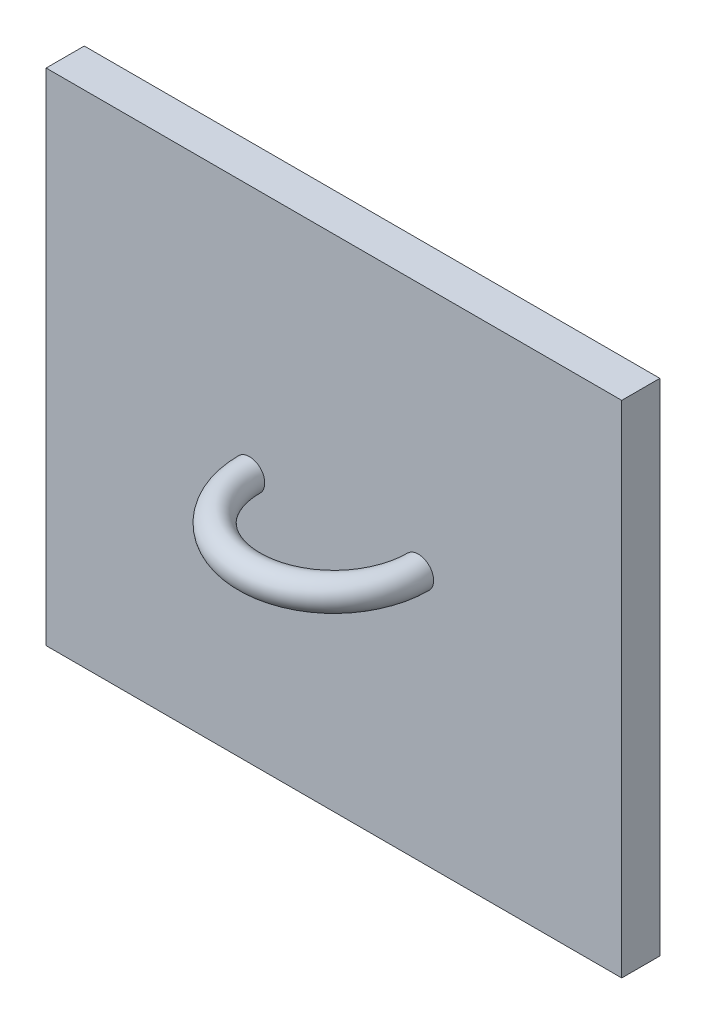
ISO-10303-21;
HEADER;
FILE_DESCRIPTION(('STEP AP214'),'2;1');
FILE_NAME('part.step','',(''),(''),'','','');
FILE_SCHEMA(('AUTOMOTIVE_DESIGN { 1 0 10303 214 1 1 1 1 }'));
ENDSEC;
DATA;
#1=APPLICATION_CONTEXT('core data for automotive mechanical design processes');
#2=APPLICATION_PROTOCOL_DEFINITION('international standard','automotive_design',2000,#1);
#3=PRODUCT_CONTEXT('',#1,'mechanical');
#4=PRODUCT('Part','Part','',(#3));
#5=PRODUCT_RELATED_PRODUCT_CATEGORY('part','',(#4));
#6=PRODUCT_DEFINITION_FORMATION('','',#4);
#7=PRODUCT_DEFINITION_CONTEXT('part definition',#1,'design');
#8=PRODUCT_DEFINITION('design','',#6,#7);
#9=PRODUCT_DEFINITION_SHAPE('','',#8);
#10=(LENGTH_UNIT() NAMED_UNIT(*) SI_UNIT(.MILLI.,.METRE.));
#11=(NAMED_UNIT(*) PLANE_ANGLE_UNIT() SI_UNIT($,.RADIAN.));
#12=(NAMED_UNIT(*) SI_UNIT($,.STERADIAN.) SOLID_ANGLE_UNIT());
#13=UNCERTAINTY_MEASURE_WITH_UNIT(LENGTH_MEASURE(1.E-05),#10,'distance_accuracy_value','');
#14=(GEOMETRIC_REPRESENTATION_CONTEXT(3) GLOBAL_UNCERTAINTY_ASSIGNED_CONTEXT((#13)) GLOBAL_UNIT_ASSIGNED_CONTEXT((#10,
#11,#12)) REPRESENTATION_CONTEXT('',''));
#15=CARTESIAN_POINT('',(0.,0.,0.));
#16=DIRECTION('',(0.,0.,1.));
#17=DIRECTION('',(1.,0.,0.));
#18=AXIS2_PLACEMENT_3D('',#15,#16,#17);
#19=CARTESIAN_POINT('',(0.,0.,12.5));
#20=DIRECTION('',(1.,0.,0.));
#21=DIRECTION('',(0.,1.,0.));
#22=AXIS2_PLACEMENT_3D('',#19,#20,#21);
#23=PLANE('',#22);
#24=DIRECTION('',(0.,-1.,0.));
#25=VECTOR('',#24,1.);
#26=CARTESIAN_POINT('',(0.,0.,0.));
#27=LINE('',#26,#25);
#28=CARTESIAN_POINT('',(0.,164.,0.));
#29=VERTEX_POINT('',#28);
#30=CARTESIAN_POINT('',(0.,0.,0.));
#31=VERTEX_POINT('',#30);
#32=EDGE_CURVE('E111',#29,#31,#27,.T.);
#33=ORIENTED_EDGE('',*,*,#32,.T.);
#34=DIRECTION('',(0.,0.,-1.));
#35=VECTOR('',#34,1.);
#36=CARTESIAN_POINT('',(0.,0.,12.5));
#37=LINE('',#36,#35);
#38=CARTESIAN_POINT('',(0.,0.,12.5));
#39=VERTEX_POINT('',#38);
#40=EDGE_CURVE('E100',#39,#31,#37,.T.);
#41=ORIENTED_EDGE('',*,*,#40,.F.);
#42=DIRECTION('',(0.,-1.,0.));
#43=VECTOR('',#42,1.);
#44=CARTESIAN_POINT('',(0.,0.,12.5));
#45=LINE('',#44,#43);
#46=CARTESIAN_POINT('',(0.,164.,12.5));
#47=VERTEX_POINT('',#46);
#48=EDGE_CURVE('E92',#47,#39,#45,.T.);
#49=ORIENTED_EDGE('',*,*,#48,.F.);
#50=DIRECTION('',(0.,0.,-1.));
#51=VECTOR('',#50,1.);
#52=CARTESIAN_POINT('',(0.,164.,12.5));
#53=LINE('',#52,#51);
#54=EDGE_CURVE('E107',#47,#29,#53,.T.);
#55=ORIENTED_EDGE('',*,*,#54,.T.);
#56=EDGE_LOOP('',(#33,#41,#49,#55));
#57=FACE_BOUND('',#56,.T.);
#58=ADVANCED_FACE('F39',(#57),#23,.F.);
#59=CARTESIAN_POINT('',(0.,0.,12.5));
#60=DIRECTION('',(0.,1.,0.));
#61=DIRECTION('',(0.,0.,1.));
#62=AXIS2_PLACEMENT_3D('',#59,#60,#61);
#63=PLANE('',#62);
#64=DIRECTION('',(1.,0.,0.));
#65=VECTOR('',#64,1.);
#66=CARTESIAN_POINT('',(0.,0.,0.));
#67=LINE('',#66,#65);
#68=CARTESIAN_POINT('',(188.7,0.,0.));
#69=VERTEX_POINT('',#68);
#70=EDGE_CURVE('E98',#31,#69,#67,.T.);
#71=ORIENTED_EDGE('',*,*,#70,.T.);
#72=DIRECTION('',(0.,0.,-1.));
#73=VECTOR('',#72,1.);
#74=CARTESIAN_POINT('',(188.7,0.,12.5));
#75=LINE('',#74,#73);
#76=CARTESIAN_POINT('',(188.7,0.,12.5));
#77=VERTEX_POINT('',#76);
#78=EDGE_CURVE('E96',#77,#69,#75,.T.);
#79=ORIENTED_EDGE('',*,*,#78,.F.);
#80=DIRECTION('',(1.,0.,0.));
#81=VECTOR('',#80,1.);
#82=CARTESIAN_POINT('',(0.,0.,12.5));
#83=LINE('',#82,#81);
#84=EDGE_CURVE('E87',#39,#77,#83,.T.);
#85=ORIENTED_EDGE('',*,*,#84,.F.);
#86=ORIENTED_EDGE('',*,*,#40,.T.);
#87=EDGE_LOOP('',(#71,#79,#85,#86));
#88=FACE_BOUND('',#87,.T.);
#89=ADVANCED_FACE('F97',(#88),#63,.F.);
#90=CARTESIAN_POINT('',(188.7,0.,12.5));
#91=DIRECTION('',(-1.,0.,0.));
#92=DIRECTION('',(0.,-1.,0.));
#93=AXIS2_PLACEMENT_3D('',#90,#91,#92);
#94=PLANE('',#93);
#95=DIRECTION('',(0.,1.,0.));
#96=VECTOR('',#95,1.);
#97=CARTESIAN_POINT('',(188.7,0.,0.));
#98=LINE('',#97,#96);
#99=CARTESIAN_POINT('',(188.7,164.,0.));
#100=VERTEX_POINT('',#99);
#101=EDGE_CURVE('E73',#69,#100,#98,.T.);
#102=ORIENTED_EDGE('',*,*,#101,.T.);
#103=DIRECTION('',(0.,0.,-1.));
#104=VECTOR('',#103,1.);
#105=CARTESIAN_POINT('',(188.7,164.,12.5));
#106=LINE('',#105,#104);
#107=CARTESIAN_POINT('',(188.7,164.,12.5));
#108=VERTEX_POINT('',#107);
#109=EDGE_CURVE('E101',#108,#100,#106,.T.);
#110=ORIENTED_EDGE('',*,*,#109,.F.);
#111=DIRECTION('',(0.,1.,0.));
#112=VECTOR('',#111,1.);
#113=CARTESIAN_POINT('',(188.7,0.,12.5));
#114=LINE('',#113,#112);
#115=EDGE_CURVE('E90',#77,#108,#114,.T.);
#116=ORIENTED_EDGE('',*,*,#115,.F.);
#117=ORIENTED_EDGE('',*,*,#78,.T.);
#118=EDGE_LOOP('',(#102,#110,#116,#117));
#119=FACE_BOUND('',#118,.T.);
#120=ADVANCED_FACE('F103',(#119),#94,.F.);
#121=CARTESIAN_POINT('',(0.,164.,12.5));
#122=DIRECTION('',(0.,-1.,0.));
#123=DIRECTION('',(0.,0.,-1.));
#124=AXIS2_PLACEMENT_3D('',#121,#122,#123);
#125=PLANE('',#124);
#126=DIRECTION('',(-1.,0.,0.));
#127=VECTOR('',#126,1.);
#128=CARTESIAN_POINT('',(0.,164.,0.));
#129=LINE('',#128,#127);
#130=EDGE_CURVE('E79',#100,#29,#129,.T.);
#131=ORIENTED_EDGE('',*,*,#130,.T.);
#132=ORIENTED_EDGE('',*,*,#54,.F.);
#133=DIRECTION('',(-1.,0.,0.));
#134=VECTOR('',#133,1.);
#135=CARTESIAN_POINT('',(0.,164.,12.5));
#136=LINE('',#135,#134);
#137=EDGE_CURVE('E56',#108,#47,#136,.T.);
#138=ORIENTED_EDGE('',*,*,#137,.F.);
#139=ORIENTED_EDGE('',*,*,#109,.T.);
#140=EDGE_LOOP('',(#131,#132,#138,#139));
#141=FACE_BOUND('',#140,.T.);
#142=ADVANCED_FACE('F134',(#141),#125,.F.);
#143=CARTESIAN_POINT('',(0.,0.,12.5));
#144=DIRECTION('',(0.,0.,-1.));
#145=DIRECTION('',(-1.,0.,0.));
#146=AXIS2_PLACEMENT_3D('',#143,#144,#145);
#147=PLANE('',#146);
#148=CARTESIAN_POINT('',(122.02381433893,82.,12.5));
#149=DIRECTION('',(0.,0.,-1.));
#150=DIRECTION('',(-1.,0.,0.));
#151=AXIS2_PLACEMENT_3D('',#148,#149,#150);
#152=CIRCLE('',#151,5.00000000000001);
#153=CARTESIAN_POINT('',(127.02381433893,82.,12.5));
#154=VERTEX_POINT('',#153);
#155=EDGE_CURVE('E11',#154,#154,#152,.F.);
#156=ORIENTED_EDGE('',*,*,#155,.F.);
#157=EDGE_LOOP('',(#156));
#158=FACE_BOUND('',#157,.T.);
#159=CARTESIAN_POINT('',(66.6761856610698,82.,12.5));
#160=DIRECTION('',(0.,0.,-1.));
#161=DIRECTION('',(-1.,0.,0.));
#162=AXIS2_PLACEMENT_3D('',#159,#160,#161);
#163=CIRCLE('',#162,5.00000000000001);
#164=CARTESIAN_POINT('',(61.6761856610698,82.,12.5));
#165=VERTEX_POINT('',#164);
#166=EDGE_CURVE('E48',#165,#165,#163,.F.);
#167=ORIENTED_EDGE('',*,*,#166,.F.);
#168=EDGE_LOOP('',(#167));
#169=FACE_BOUND('',#168,.T.);
#170=ORIENTED_EDGE('',*,*,#48,.T.);
#171=ORIENTED_EDGE('',*,*,#84,.T.);
#172=ORIENTED_EDGE('',*,*,#115,.T.);
#173=ORIENTED_EDGE('',*,*,#137,.T.);
#174=EDGE_LOOP('',(#170,#171,#172,#173));
#175=FACE_BOUND('',#174,.T.);
#176=ADVANCED_FACE('F88',(#158,#169,#175),#147,.F.);
#177=CARTESIAN_POINT('',(0.,0.,0.));
#178=DIRECTION('',(0.,0.,-1.));
#179=DIRECTION('',(-1.,0.,0.));
#180=AXIS2_PLACEMENT_3D('',#177,#178,#179);
#181=PLANE('',#180);
#182=ORIENTED_EDGE('',*,*,#32,.F.);
#183=ORIENTED_EDGE('',*,*,#130,.F.);
#184=ORIENTED_EDGE('',*,*,#101,.F.);
#185=ORIENTED_EDGE('',*,*,#70,.F.);
#186=EDGE_LOOP('',(#182,#183,#184,#185));
#187=FACE_BOUND('',#186,.T.);
#188=ADVANCED_FACE('F133',(#187),#181,.T.);
#189=CARTESIAN_POINT('',(94.35,82.,12.5));
#190=DIRECTION('',(0.,-1.,0.));
#191=DIRECTION('',(1.,0.,0.));
#192=AXIS2_PLACEMENT_3D('',#189,#190,#191);
#193=TOROIDAL_SURFACE('',#192,27.6738143389302,5.00000000000001);
#194=CARTESIAN_POINT('',(94.35,82.,12.5));
#195=DIRECTION('',(0.,-1.,0.));
#196=DIRECTION('',(1.,0.,0.));
#197=AXIS2_PLACEMENT_3D('',#194,#195,#196);
#198=CIRCLE('',#197,32.6738143389302);
#199=EDGE_CURVE('',#154,#165,#198,.T.);
#200=ORIENTED_EDGE('',*,*,#155,.T.);
#201=ORIENTED_EDGE('',*,*,#166,.T.);
#202=ORIENTED_EDGE('',*,*,#199,.T.);
#203=ORIENTED_EDGE('',*,*,#199,.F.);
#204=EDGE_LOOP('',(#200,#202,#201,#203));
#205=FACE_BOUND('',#204,.T.);
#206=ADVANCED_FACE('F130',(#205),#193,.T.);
#207=CLOSED_SHELL('',(#58,#89,#120,#142,#176,#188,#206));
#208=MANIFOLD_SOLID_BREP('B2',#207);
#209=ADVANCED_BREP_SHAPE_REPRESENTATION('',(#18,#208),#14);
#210=SHAPE_DEFINITION_REPRESENTATION(#9,#209);
ENDSEC;
END-ISO-10303-21;
